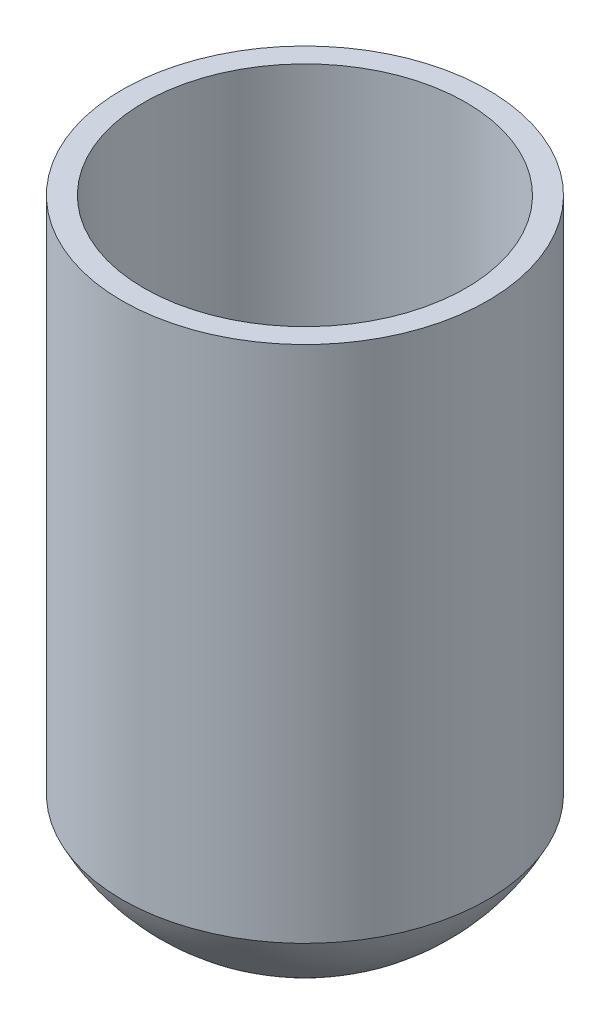
ISO-10303-21;
HEADER;
FILE_DESCRIPTION(('STEP AP214'),'2;1');
FILE_NAME('part.step','',(''),(''),'','','');
FILE_SCHEMA(('AUTOMOTIVE_DESIGN { 1 0 10303 214 1 1 1 1 }'));
ENDSEC;
DATA;
#1=APPLICATION_CONTEXT('core data for automotive mechanical design processes');
#2=APPLICATION_PROTOCOL_DEFINITION('international standard','automotive_design',2000,#1);
#3=PRODUCT_CONTEXT('',#1,'mechanical');
#4=PRODUCT('Part','Part','',(#3));
#5=PRODUCT_RELATED_PRODUCT_CATEGORY('part','',(#4));
#6=PRODUCT_DEFINITION_FORMATION('','',#4);
#7=PRODUCT_DEFINITION_CONTEXT('part definition',#1,'design');
#8=PRODUCT_DEFINITION('design','',#6,#7);
#9=PRODUCT_DEFINITION_SHAPE('','',#8);
#10=(LENGTH_UNIT() NAMED_UNIT(*) SI_UNIT(.MILLI.,.METRE.));
#11=(NAMED_UNIT(*) PLANE_ANGLE_UNIT() SI_UNIT($,.RADIAN.));
#12=(NAMED_UNIT(*) SI_UNIT($,.STERADIAN.) SOLID_ANGLE_UNIT());
#13=UNCERTAINTY_MEASURE_WITH_UNIT(LENGTH_MEASURE(1.E-05),#10,'distance_accuracy_value','');
#14=(GEOMETRIC_REPRESENTATION_CONTEXT(3) GLOBAL_UNCERTAINTY_ASSIGNED_CONTEXT((#13)) GLOBAL_UNIT_ASSIGNED_CONTEXT((#10,
#11,#12)) REPRESENTATION_CONTEXT('',''));
#15=CARTESIAN_POINT('',(0.,0.,0.));
#16=DIRECTION('',(0.,0.,1.));
#17=DIRECTION('',(1.,0.,0.));
#18=AXIS2_PLACEMENT_3D('',#15,#16,#17);
#19=CARTESIAN_POINT('',(0.,69.85,0.));
#20=DIRECTION('',(0.,1.,0.));
#21=DIRECTION('',(0.,0.,1.));
#22=AXIS2_PLACEMENT_3D('',#19,#20,#21);
#23=PLANE('',#22);
#24=CARTESIAN_POINT('',(0.,69.85,0.));
#25=DIRECTION('',(0.,1.,0.));
#26=DIRECTION('',(0.,0.,1.));
#27=AXIS2_PLACEMENT_3D('',#24,#25,#26);
#28=CIRCLE('',#27,28.65374);
#29=CARTESIAN_POINT('',(0.,69.85,28.65374));
#30=VERTEX_POINT('',#29);
#31=EDGE_CURVE('E10',#30,#30,#28,.T.);
#32=ORIENTED_EDGE('',*,*,#31,.T.);
#33=EDGE_LOOP('',(#32));
#34=FACE_BOUND('',#33,.T.);
#35=CARTESIAN_POINT('',(0.,69.85,0.));
#36=DIRECTION('',(0.,1.,0.));
#37=DIRECTION('',(0.,0.,1.));
#38=AXIS2_PLACEMENT_3D('',#35,#36,#37);
#39=CIRCLE('',#38,25.2222);
#40=CARTESIAN_POINT('',(0.,69.85,25.2222));
#41=VERTEX_POINT('',#40);
#42=EDGE_CURVE('E43',#41,#41,#39,.T.);
#43=ORIENTED_EDGE('',*,*,#42,.F.);
#44=EDGE_LOOP('',(#43));
#45=FACE_BOUND('',#44,.T.);
#46=ADVANCED_FACE('F35',(#34,#45),#23,.T.);
#47=CARTESIAN_POINT('',(0.,69.85,0.));
#48=DIRECTION('',(0.,-1.,0.));
#49=DIRECTION('',(0.,0.,-1.));
#50=AXIS2_PLACEMENT_3D('',#47,#48,#49);
#51=CYLINDRICAL_SURFACE('',#50,28.65374);
#52=ORIENTED_EDGE('',*,*,#31,.F.);
#53=EDGE_LOOP('',(#52));
#54=FACE_BOUND('',#53,.T.);
#55=CARTESIAN_POINT('',(0.,-11.43,0.));
#56=DIRECTION('',(0.,1.,0.));
#57=DIRECTION('',(0.,0.,1.));
#58=AXIS2_PLACEMENT_3D('',#55,#56,#57);
#59=CIRCLE('',#58,28.65374);
#60=CARTESIAN_POINT('',(0.,-11.43,28.65374));
#61=VERTEX_POINT('',#60);
#62=EDGE_CURVE('E39',#61,#61,#59,.T.);
#63=ORIENTED_EDGE('',*,*,#62,.T.);
#64=EDGE_LOOP('',(#63));
#65=FACE_BOUND('',#64,.T.);
#66=ADVANCED_FACE('F56',(#54,#65),#51,.T.);
#67=CARTESIAN_POINT('',(0.,69.85,0.));
#68=DIRECTION('',(0.,-1.,0.));
#69=DIRECTION('',(0.,0.,-1.));
#70=AXIS2_PLACEMENT_3D('',#67,#68,#69);
#71=CYLINDRICAL_SURFACE('',#70,25.2222);
#72=ORIENTED_EDGE('',*,*,#42,.T.);
#73=EDGE_LOOP('',(#72));
#74=FACE_BOUND('',#73,.T.);
#75=CARTESIAN_POINT('',(0.,0.,0.));
#76=DIRECTION('',(0.,1.,0.));
#77=DIRECTION('',(0.,0.,1.));
#78=AXIS2_PLACEMENT_3D('',#75,#76,#77);
#79=CIRCLE('',#78,25.2222);
#80=CARTESIAN_POINT('',(0.,0.,25.2222));
#81=VERTEX_POINT('',#80);
#82=EDGE_CURVE('E47',#81,#81,#79,.T.);
#83=ORIENTED_EDGE('',*,*,#82,.F.);
#84=EDGE_LOOP('',(#83));
#85=FACE_BOUND('',#84,.T.);
#86=ADVANCED_FACE('F63',(#74,#85),#71,.F.);
#87=CARTESIAN_POINT('',(0.,0.,0.));
#88=DIRECTION('',(0.,1.,0.));
#89=DIRECTION('',(0.,0.,1.));
#90=AXIS2_PLACEMENT_3D('',#87,#88,#89);
#91=PLANE('',#90);
#92=ORIENTED_EDGE('',*,*,#82,.T.);
#93=EDGE_LOOP('',(#92));
#94=FACE_BOUND('',#93,.T.);
#95=ADVANCED_FACE('F59',(#94),#91,.T.);
#96=CARTESIAN_POINT('',(0.,2.76877435285716,0.));
#97=DIRECTION('',(0.,0.,1.));
#98=DIRECTION('',(1.,0.,0.));
#99=AXIS2_PLACEMENT_3D('',#96,#97,#98);
#100=SPHERICAL_SURFACE('',#99,31.9787743528572);
#101=CARTESIAN_POINT('',(0.,2.76877435285716,0.));
#102=DIRECTION('',(0.,1.,0.));
#103=DIRECTION('',(0.,0.,1.));
#104=AXIS2_PLACEMENT_3D('',#101,#102,#103);
#105=SPHERICAL_SURFACE('',#104,31.9787743528572);
#106=ORIENTED_EDGE('',*,*,#62,.F.);
#107=EDGE_LOOP('',(#106));
#108=FACE_BOUND('',#107,.T.);
#109=ADVANCED_FACE('F37',(#108),#105,.T.);
#110=CLOSED_SHELL('',(#46,#66,#86,#95,#109));
#111=MANIFOLD_SOLID_BREP('B2',#110);
#112=ADVANCED_BREP_SHAPE_REPRESENTATION('',(#18,#111),#14);
#113=SHAPE_DEFINITION_REPRESENTATION(#9,#112);
ENDSEC;
END-ISO-10303-21;
